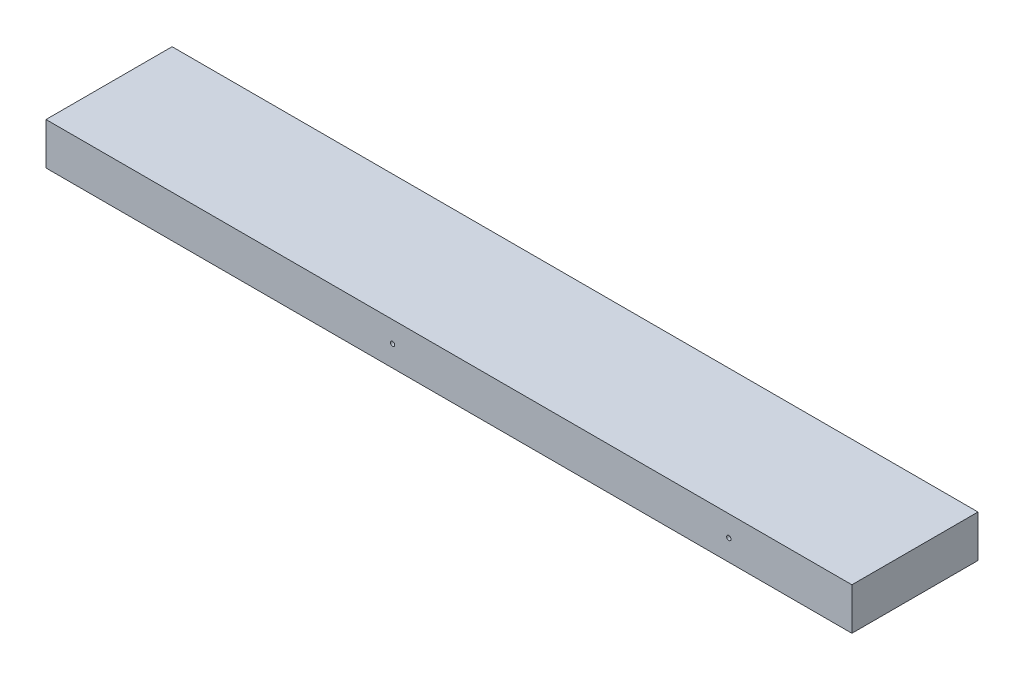
ISO-10303-21;
HEADER;
FILE_DESCRIPTION(('STEP AP214'),'2;1');
FILE_NAME('part.step','',(''),(''),'','','');
FILE_SCHEMA(('AUTOMOTIVE_DESIGN { 1 0 10303 214 1 1 1 1 }'));
ENDSEC;
DATA;
#1=APPLICATION_CONTEXT('core data for automotive mechanical design processes');
#2=APPLICATION_PROTOCOL_DEFINITION('international standard','automotive_design',2000,#1);
#3=PRODUCT_CONTEXT('',#1,'mechanical');
#4=PRODUCT('Part','Part','',(#3));
#5=PRODUCT_RELATED_PRODUCT_CATEGORY('part','',(#4));
#6=PRODUCT_DEFINITION_FORMATION('','',#4);
#7=PRODUCT_DEFINITION_CONTEXT('part definition',#1,'design');
#8=PRODUCT_DEFINITION('design','',#6,#7);
#9=PRODUCT_DEFINITION_SHAPE('','',#8);
#10=(LENGTH_UNIT() NAMED_UNIT(*) SI_UNIT(.MILLI.,.METRE.));
#11=(NAMED_UNIT(*) PLANE_ANGLE_UNIT() SI_UNIT($,.RADIAN.));
#12=(NAMED_UNIT(*) SI_UNIT($,.STERADIAN.) SOLID_ANGLE_UNIT());
#13=UNCERTAINTY_MEASURE_WITH_UNIT(LENGTH_MEASURE(1.E-05),#10,'distance_accuracy_value','');
#14=(GEOMETRIC_REPRESENTATION_CONTEXT(3) GLOBAL_UNCERTAINTY_ASSIGNED_CONTEXT((#13)) GLOBAL_UNIT_ASSIGNED_CONTEXT((#10,
#11,#12)) REPRESENTATION_CONTEXT('',''));
#15=CARTESIAN_POINT('',(0.,0.,0.));
#16=DIRECTION('',(0.,0.,1.));
#17=DIRECTION('',(1.,0.,0.));
#18=AXIS2_PLACEMENT_3D('',#15,#16,#17);
#19=CARTESIAN_POINT('',(-86.3599999999994,5213.35,2683.51));
#20=DIRECTION('',(0.,-1.,0.));
#21=DIRECTION('',(0.,0.,-1.));
#22=AXIS2_PLACEMENT_3D('',#19,#20,#21);
#23=PLANE('',#22);
#24=DIRECTION('',(-1.,0.,0.));
#25=VECTOR('',#24,1.);
#26=CARTESIAN_POINT('',(-265.81557086487,5213.35,2683.51));
#27=LINE('',#26,#25);
#28=CARTESIAN_POINT('',(-80.0099999999993,5213.35,2683.51));
#29=VERTEX_POINT('',#28);
#30=CARTESIAN_POINT('',(-445.271141729743,5213.35,2683.51));
#31=VERTEX_POINT('',#30);
#32=EDGE_CURVE('E154',#29,#31,#27,.T.);
#33=ORIENTED_EDGE('',*,*,#32,.F.);
#34=DIRECTION('',(0.,0.,1.));
#35=VECTOR('',#34,1.);
#36=CARTESIAN_POINT('',(-80.0099999999993,5213.35,2683.51));
#37=LINE('',#36,#35);
#38=CARTESIAN_POINT('',(-80.0099999999993,5213.35,2740.66));
#39=VERTEX_POINT('',#38);
#40=EDGE_CURVE('E145',#29,#39,#37,.T.);
#41=ORIENTED_EDGE('',*,*,#40,.T.);
#42=DIRECTION('',(1.,0.,0.));
#43=VECTOR('',#42,1.);
#44=CARTESIAN_POINT('',(-265.815570864872,5213.35000000001,2740.66));
#45=LINE('',#44,#43);
#46=CARTESIAN_POINT('',(-445.271141729744,5213.35,2740.66));
#47=VERTEX_POINT('',#46);
#48=EDGE_CURVE('E148',#47,#39,#45,.T.);
#49=ORIENTED_EDGE('',*,*,#48,.F.);
#50=DIRECTION('',(0.,0.,-1.));
#51=VECTOR('',#50,1.);
#52=CARTESIAN_POINT('',(-445.271141729743,5213.35,2683.51));
#53=LINE('',#52,#51);
#54=EDGE_CURVE('E157',#47,#31,#53,.T.);
#55=ORIENTED_EDGE('',*,*,#54,.T.);
#56=EDGE_LOOP('',(#33,#41,#49,#55));
#57=FACE_BOUND('',#56,.T.);
#58=ADVANCED_FACE('F49',(#57),#23,.T.);
#59=CARTESIAN_POINT('',(-265.815570864872,5222.875,2740.66));
#60=DIRECTION('',(0.,0.,-1.));
#61=DIRECTION('',(1.,0.,0.));
#62=AXIS2_PLACEMENT_3D('',#59,#60,#61);
#63=PLANE('',#62);
#64=CARTESIAN_POINT('',(-135.802759022741,5222.87500000001,2740.66));
#65=DIRECTION('',(0.,0.,1.));
#66=DIRECTION('',(1.,0.,0.));
#67=AXIS2_PLACEMENT_3D('',#64,#65,#66);
#68=CIRCLE('',#67,0.991870000000006);
#69=CARTESIAN_POINT('',(-134.810889022741,5222.87500000001,2740.66));
#70=VERTEX_POINT('',#69);
#71=EDGE_CURVE('E52',#70,#70,#68,.T.);
#72=ORIENTED_EDGE('',*,*,#71,.F.);
#73=EDGE_LOOP('',(#72));
#74=FACE_BOUND('',#73,.T.);
#75=CARTESIAN_POINT('',(-288.20275902274,5222.87500000001,2740.66));
#76=DIRECTION('',(0.,0.,1.));
#77=DIRECTION('',(1.,0.,0.));
#78=AXIS2_PLACEMENT_3D('',#75,#76,#77);
#79=CIRCLE('',#78,0.991870000000006);
#80=CARTESIAN_POINT('',(-287.21088902274,5222.87500000001,2740.66));
#81=VERTEX_POINT('',#80);
#82=EDGE_CURVE('E129',#81,#81,#79,.T.);
#83=ORIENTED_EDGE('',*,*,#82,.F.);
#84=EDGE_LOOP('',(#83));
#85=FACE_BOUND('',#84,.T.);
#86=DIRECTION('',(-1.,0.,0.));
#87=VECTOR('',#86,1.);
#88=CARTESIAN_POINT('',(-445.271141729743,5232.40000000001,2740.66));
#89=LINE('',#88,#87);
#90=CARTESIAN_POINT('',(-80.0099999999995,5232.4,2740.66));
#91=VERTEX_POINT('',#90);
#92=CARTESIAN_POINT('',(-445.271141729743,5232.4,2740.66));
#93=VERTEX_POINT('',#92);
#94=EDGE_CURVE('E151',#91,#93,#89,.T.);
#95=ORIENTED_EDGE('',*,*,#94,.T.);
#96=DIRECTION('',(0.,1.,0.));
#97=VECTOR('',#96,1.);
#98=CARTESIAN_POINT('',(-445.271141729744,5213.35,2740.66));
#99=LINE('',#98,#97);
#100=EDGE_CURVE('E83',#93,#47,#99,.F.);
#101=ORIENTED_EDGE('',*,*,#100,.T.);
#102=ORIENTED_EDGE('',*,*,#48,.T.);
#103=DIRECTION('',(0.,1.,0.));
#104=VECTOR('',#103,1.);
#105=CARTESIAN_POINT('',(-80.0099999999993,5213.35,2740.66));
#106=LINE('',#105,#104);
#107=EDGE_CURVE('E93',#39,#91,#106,.T.);
#108=ORIENTED_EDGE('',*,*,#107,.T.);
#109=EDGE_LOOP('',(#95,#101,#102,#108));
#110=FACE_BOUND('',#109,.T.);
#111=ADVANCED_FACE('F171',(#74,#85,#110),#63,.F.);
#112=CARTESIAN_POINT('',(-445.271141729743,5213.35,2683.51));
#113=DIRECTION('',(-1.,0.,0.));
#114=DIRECTION('',(0.,0.,-1.));
#115=AXIS2_PLACEMENT_3D('',#112,#113,#114);
#116=PLANE('',#115);
#117=DIRECTION('',(0.,1.,0.));
#118=VECTOR('',#117,1.);
#119=CARTESIAN_POINT('',(-445.271141729742,5222.875,2683.51));
#120=LINE('',#119,#118);
#121=CARTESIAN_POINT('',(-445.271141729743,5232.4,2683.51));
#122=VERTEX_POINT('',#121);
#123=EDGE_CURVE('E76',#31,#122,#120,.T.);
#124=ORIENTED_EDGE('',*,*,#123,.F.);
#125=ORIENTED_EDGE('',*,*,#54,.F.);
#126=ORIENTED_EDGE('',*,*,#100,.F.);
#127=DIRECTION('',(0.,0.,1.));
#128=VECTOR('',#127,1.);
#129=CARTESIAN_POINT('',(-445.271141729743,5232.4,2683.51));
#130=LINE('',#129,#128);
#131=EDGE_CURVE('E58',#93,#122,#130,.F.);
#132=ORIENTED_EDGE('',*,*,#131,.T.);
#133=EDGE_LOOP('',(#124,#125,#126,#132));
#134=FACE_BOUND('',#133,.T.);
#135=ADVANCED_FACE('F173',(#134),#116,.T.);
#136=CARTESIAN_POINT('',(-265.815570864871,5222.87500000001,2683.51));
#137=DIRECTION('',(0.,0.,1.));
#138=DIRECTION('',(-1.,0.,0.));
#139=AXIS2_PLACEMENT_3D('',#136,#137,#138);
#140=PLANE('',#139);
#141=CARTESIAN_POINT('',(-415.202759022741,5222.875,2683.51));
#142=DIRECTION('',(0.,0.,-1.));
#143=DIRECTION('',(-1.,0.,0.));
#144=AXIS2_PLACEMENT_3D('',#141,#142,#143);
#145=CIRCLE('',#144,0.991870000000006);
#146=CARTESIAN_POINT('',(-416.194629022741,5222.875,2683.51));
#147=VERTEX_POINT('',#146);
#148=EDGE_CURVE('E133',#147,#147,#145,.T.);
#149=ORIENTED_EDGE('',*,*,#148,.F.);
#150=EDGE_LOOP('',(#149));
#151=FACE_BOUND('',#150,.T.);
#152=CARTESIAN_POINT('',(-313.602759022741,5222.87500000001,2683.51));
#153=DIRECTION('',(0.,0.,-1.));
#154=DIRECTION('',(-1.,0.,0.));
#155=AXIS2_PLACEMENT_3D('',#152,#153,#154);
#156=CIRCLE('',#155,0.991870000000006);
#157=CARTESIAN_POINT('',(-314.594629022741,5222.87500000001,2683.51));
#158=VERTEX_POINT('',#157);
#159=EDGE_CURVE('E137',#158,#158,#156,.T.);
#160=ORIENTED_EDGE('',*,*,#159,.F.);
#161=EDGE_LOOP('',(#160));
#162=FACE_BOUND('',#161,.T.);
#163=CARTESIAN_POINT('',(-110.40275902274,5222.875,2683.51));
#164=DIRECTION('',(0.,0.,-1.));
#165=DIRECTION('',(-1.,0.,0.));
#166=AXIS2_PLACEMENT_3D('',#163,#164,#165);
#167=CIRCLE('',#166,0.991870000000006);
#168=CARTESIAN_POINT('',(-111.39462902274,5222.875,2683.51));
#169=VERTEX_POINT('',#168);
#170=EDGE_CURVE('E141',#169,#169,#167,.T.);
#171=ORIENTED_EDGE('',*,*,#170,.F.);
#172=EDGE_LOOP('',(#171));
#173=FACE_BOUND('',#172,.T.);
#174=ORIENTED_EDGE('',*,*,#123,.T.);
#175=DIRECTION('',(-1.,0.,0.));
#176=VECTOR('',#175,1.);
#177=CARTESIAN_POINT('',(-445.271141729743,5232.4,2683.51));
#178=LINE('',#177,#176);
#179=CARTESIAN_POINT('',(-80.0099999999994,5232.40000000001,2683.51));
#180=VERTEX_POINT('',#179);
#181=EDGE_CURVE('E13',#122,#180,#178,.F.);
#182=ORIENTED_EDGE('',*,*,#181,.T.);
#183=DIRECTION('',(0.,-1.,0.));
#184=VECTOR('',#183,1.);
#185=CARTESIAN_POINT('',(-80.0099999999994,5232.40000000001,2683.51));
#186=LINE('',#185,#184);
#187=EDGE_CURVE('E143',#180,#29,#186,.T.);
#188=ORIENTED_EDGE('',*,*,#187,.T.);
#189=ORIENTED_EDGE('',*,*,#32,.T.);
#190=EDGE_LOOP('',(#174,#182,#188,#189));
#191=FACE_BOUND('',#190,.T.);
#192=ADVANCED_FACE('F182',(#151,#162,#173,#191),#140,.F.);
#193=CARTESIAN_POINT('',(-445.271141729743,5232.4,2683.51));
#194=DIRECTION('',(0.,1.,0.));
#195=DIRECTION('',(0.,0.,1.));
#196=AXIS2_PLACEMENT_3D('',#193,#194,#195);
#197=PLANE('',#196);
#198=ORIENTED_EDGE('',*,*,#181,.F.);
#199=ORIENTED_EDGE('',*,*,#131,.F.);
#200=ORIENTED_EDGE('',*,*,#94,.F.);
#201=DIRECTION('',(0.,0.,-1.));
#202=VECTOR('',#201,1.);
#203=CARTESIAN_POINT('',(-80.0099999999995,5232.4,2740.66));
#204=LINE('',#203,#202);
#205=EDGE_CURVE('E89',#91,#180,#204,.T.);
#206=ORIENTED_EDGE('',*,*,#205,.T.);
#207=EDGE_LOOP('',(#198,#199,#200,#206));
#208=FACE_BOUND('',#207,.T.);
#209=ADVANCED_FACE('F176',(#208),#197,.T.);
#210=CARTESIAN_POINT('',(-80.0099999999993,1.77635683940025E-12,4.44089209850063E-13));
#211=DIRECTION('',(1.,0.,0.));
#212=DIRECTION('',(0.,0.,1.));
#213=AXIS2_PLACEMENT_3D('',#210,#211,#212);
#214=PLANE('',#213);
#215=ORIENTED_EDGE('',*,*,#205,.F.);
#216=ORIENTED_EDGE('',*,*,#107,.F.);
#217=ORIENTED_EDGE('',*,*,#40,.F.);
#218=ORIENTED_EDGE('',*,*,#187,.F.);
#219=EDGE_LOOP('',(#215,#216,#217,#218));
#220=FACE_BOUND('',#219,.T.);
#221=ADVANCED_FACE('F180',(#220),#214,.T.);
#222=CARTESIAN_POINT('',(-110.402759022741,5222.87500000001,2664.46));
#223=DIRECTION('',(0.,0.,-1.));
#224=DIRECTION('',(1.,0.,0.));
#225=AXIS2_PLACEMENT_3D('',#222,#223,#224);
#226=CYLINDRICAL_SURFACE('',#225,0.991870000000006);
#227=CARTESIAN_POINT('',(-110.40275902274,5222.875,2702.56));
#228=DIRECTION('',(0.,0.,1.));
#229=DIRECTION('',(1.,0.,0.));
#230=AXIS2_PLACEMENT_3D('',#227,#228,#229);
#231=CIRCLE('',#230,0.991870000000006);
#232=CARTESIAN_POINT('',(-109.41088902274,5222.875,2702.56));
#233=VERTEX_POINT('',#232);
#234=EDGE_CURVE('E138',#233,#233,#231,.T.);
#235=ORIENTED_EDGE('',*,*,#234,.T.);
#236=EDGE_LOOP('',(#235));
#237=FACE_BOUND('',#236,.T.);
#238=ORIENTED_EDGE('',*,*,#170,.T.);
#239=EDGE_LOOP('',(#238));
#240=FACE_BOUND('',#239,.T.);
#241=ADVANCED_FACE('F226',(#237,#240),#226,.F.);
#242=CARTESIAN_POINT('',(-110.40275902274,5222.875,2702.56));
#243=DIRECTION('',(0.,0.,-1.));
#244=DIRECTION('',(1.,0.,0.));
#245=AXIS2_PLACEMENT_3D('',#242,#243,#244);
#246=CONICAL_SURFACE('',#245,0.991870000000006,1.02974425867677);
#247=CARTESIAN_POINT('',(-110.402759022741,5222.87500000001,2703.1559756222));
#248=VERTEX_POINT('',#247);
#249=VERTEX_LOOP('',#248);
#250=FACE_BOUND('',#249,.T.);
#251=ORIENTED_EDGE('',*,*,#234,.F.);
#252=EDGE_LOOP('',(#251));
#253=FACE_BOUND('',#252,.T.);
#254=ADVANCED_FACE('F235',(#250,#253),#246,.F.);
#255=CARTESIAN_POINT('',(-313.602759022741,5222.87500000001,2664.46));
#256=DIRECTION('',(0.,0.,-1.));
#257=DIRECTION('',(1.,0.,0.));
#258=AXIS2_PLACEMENT_3D('',#255,#256,#257);
#259=CYLINDRICAL_SURFACE('',#258,0.991870000000006);
#260=CARTESIAN_POINT('',(-313.602759022741,5222.875,2702.56));
#261=DIRECTION('',(0.,0.,1.));
#262=DIRECTION('',(1.,0.,0.));
#263=AXIS2_PLACEMENT_3D('',#260,#261,#262);
#264=CIRCLE('',#263,0.991870000000006);
#265=CARTESIAN_POINT('',(-312.610889022741,5222.875,2702.56));
#266=VERTEX_POINT('',#265);
#267=EDGE_CURVE('E134',#266,#266,#264,.T.);
#268=ORIENTED_EDGE('',*,*,#267,.T.);
#269=EDGE_LOOP('',(#268));
#270=FACE_BOUND('',#269,.T.);
#271=ORIENTED_EDGE('',*,*,#159,.T.);
#272=EDGE_LOOP('',(#271));
#273=FACE_BOUND('',#272,.T.);
#274=ADVANCED_FACE('F245',(#270,#273),#259,.F.);
#275=CARTESIAN_POINT('',(-313.602759022741,5222.875,2702.56));
#276=DIRECTION('',(0.,0.,-1.));
#277=DIRECTION('',(1.,0.,0.));
#278=AXIS2_PLACEMENT_3D('',#275,#276,#277);
#279=CONICAL_SURFACE('',#278,0.991870000000006,1.02974425867677);
#280=CARTESIAN_POINT('',(-313.60275902274,5222.875,2703.1559756222));
#281=VERTEX_POINT('',#280);
#282=VERTEX_LOOP('',#281);
#283=FACE_BOUND('',#282,.T.);
#284=ORIENTED_EDGE('',*,*,#267,.F.);
#285=EDGE_LOOP('',(#284));
#286=FACE_BOUND('',#285,.T.);
#287=ADVANCED_FACE('F255',(#283,#286),#279,.F.);
#288=CARTESIAN_POINT('',(-415.202759022741,5222.875,2664.46));
#289=DIRECTION('',(0.,0.,-1.));
#290=DIRECTION('',(1.,0.,0.));
#291=AXIS2_PLACEMENT_3D('',#288,#289,#290);
#292=CYLINDRICAL_SURFACE('',#291,0.991870000000006);
#293=CARTESIAN_POINT('',(-415.20275902274,5222.875,2702.56));
#294=DIRECTION('',(0.,0.,1.));
#295=DIRECTION('',(1.,0.,0.));
#296=AXIS2_PLACEMENT_3D('',#293,#294,#295);
#297=CIRCLE('',#296,0.991870000000006);
#298=CARTESIAN_POINT('',(-414.21088902274,5222.875,2702.56));
#299=VERTEX_POINT('',#298);
#300=EDGE_CURVE('E130',#299,#299,#297,.T.);
#301=ORIENTED_EDGE('',*,*,#300,.T.);
#302=EDGE_LOOP('',(#301));
#303=FACE_BOUND('',#302,.T.);
#304=ORIENTED_EDGE('',*,*,#148,.T.);
#305=EDGE_LOOP('',(#304));
#306=FACE_BOUND('',#305,.T.);
#307=ADVANCED_FACE('F265',(#303,#306),#292,.F.);
#308=CARTESIAN_POINT('',(-415.20275902274,5222.875,2702.56));
#309=DIRECTION('',(0.,0.,-1.));
#310=DIRECTION('',(1.,0.,0.));
#311=AXIS2_PLACEMENT_3D('',#308,#309,#310);
#312=CONICAL_SURFACE('',#311,0.991870000000006,1.02974425867677);
#313=CARTESIAN_POINT('',(-415.20275902274,5222.875,2703.1559756222));
#314=VERTEX_POINT('',#313);
#315=VERTEX_LOOP('',#314);
#316=FACE_BOUND('',#315,.T.);
#317=ORIENTED_EDGE('',*,*,#300,.F.);
#318=EDGE_LOOP('',(#317));
#319=FACE_BOUND('',#318,.T.);
#320=ADVANCED_FACE('F275',(#316,#319),#312,.F.);
#321=CARTESIAN_POINT('',(-288.202759022741,5222.87500000001,2759.71000000001));
#322=DIRECTION('',(0.,0.,1.));
#323=DIRECTION('',(-1.,0.,0.));
#324=AXIS2_PLACEMENT_3D('',#321,#322,#323);
#325=CYLINDRICAL_SURFACE('',#324,0.991870000000006);
#326=CARTESIAN_POINT('',(-288.202759022741,5222.875,2721.61000000001));
#327=DIRECTION('',(0.,0.,-1.));
#328=DIRECTION('',(-1.,0.,0.));
#329=AXIS2_PLACEMENT_3D('',#326,#327,#328);
#330=CIRCLE('',#329,0.991870000000006);
#331=CARTESIAN_POINT('',(-289.194629022741,5222.875,2721.61000000001));
#332=VERTEX_POINT('',#331);
#333=EDGE_CURVE('E125',#332,#332,#330,.T.);
#334=ORIENTED_EDGE('',*,*,#333,.T.);
#335=EDGE_LOOP('',(#334));
#336=FACE_BOUND('',#335,.T.);
#337=ORIENTED_EDGE('',*,*,#82,.T.);
#338=EDGE_LOOP('',(#337));
#339=FACE_BOUND('',#338,.T.);
#340=ADVANCED_FACE('F169',(#336,#339),#325,.F.);
#341=CARTESIAN_POINT('',(-288.202759022741,5222.875,2721.61000000001));
#342=DIRECTION('',(0.,0.,1.));
#343=DIRECTION('',(-1.,0.,0.));
#344=AXIS2_PLACEMENT_3D('',#341,#342,#343);
#345=CONICAL_SURFACE('',#344,0.991870000000006,1.02974425867677);
#346=CARTESIAN_POINT('',(-288.202759022741,5222.875,2721.01402437781));
#347=VERTEX_POINT('',#346);
#348=VERTEX_LOOP('',#347);
#349=FACE_BOUND('',#348,.T.);
#350=ORIENTED_EDGE('',*,*,#333,.F.);
#351=EDGE_LOOP('',(#350));
#352=FACE_BOUND('',#351,.T.);
#353=ADVANCED_FACE('F294',(#349,#352),#345,.F.);
#354=CARTESIAN_POINT('',(-135.802759022741,5222.87500000001,2759.71000000001));
#355=DIRECTION('',(0.,0.,1.));
#356=DIRECTION('',(-1.,0.,0.));
#357=AXIS2_PLACEMENT_3D('',#354,#355,#356);
#358=CYLINDRICAL_SURFACE('',#357,0.991870000000006);
#359=CARTESIAN_POINT('',(-135.802759022741,5222.87500000001,2721.61000000001));
#360=DIRECTION('',(0.,0.,-1.));
#361=DIRECTION('',(-1.,0.,0.));
#362=AXIS2_PLACEMENT_3D('',#359,#360,#361);
#363=CIRCLE('',#362,0.991870000000006);
#364=CARTESIAN_POINT('',(-136.794629022741,5222.87500000001,2721.61000000001));
#365=VERTEX_POINT('',#364);
#366=EDGE_CURVE('E121',#365,#365,#363,.T.);
#367=ORIENTED_EDGE('',*,*,#366,.T.);
#368=EDGE_LOOP('',(#367));
#369=FACE_BOUND('',#368,.T.);
#370=ORIENTED_EDGE('',*,*,#71,.T.);
#371=EDGE_LOOP('',(#370));
#372=FACE_BOUND('',#371,.T.);
#373=ADVANCED_FACE('F117',(#369,#372),#358,.F.);
#374=CARTESIAN_POINT('',(-135.802759022741,5222.87500000001,2721.61000000001));
#375=DIRECTION('',(0.,0.,1.));
#376=DIRECTION('',(-1.,0.,0.));
#377=AXIS2_PLACEMENT_3D('',#374,#375,#376);
#378=CONICAL_SURFACE('',#377,0.991870000000006,1.02974425867677);
#379=CARTESIAN_POINT('',(-135.80275902274,5222.87500000001,2721.01402437781));
#380=VERTEX_POINT('',#379);
#381=VERTEX_LOOP('',#380);
#382=FACE_BOUND('',#381,.T.);
#383=ORIENTED_EDGE('',*,*,#366,.F.);
#384=EDGE_LOOP('',(#383));
#385=FACE_BOUND('',#384,.T.);
#386=ADVANCED_FACE('F114',(#382,#385),#378,.F.);
#387=CLOSED_SHELL('',(#58,#111,#135,#192,#209,#221,#241,#254,#274,#287,#307,#320,#340,#353,#373,#386));
#388=MANIFOLD_SOLID_BREP('B2',#387);
#389=ADVANCED_BREP_SHAPE_REPRESENTATION('',(#18,#388),#14);
#390=SHAPE_DEFINITION_REPRESENTATION(#9,#389);
ENDSEC;
END-ISO-10303-21;
